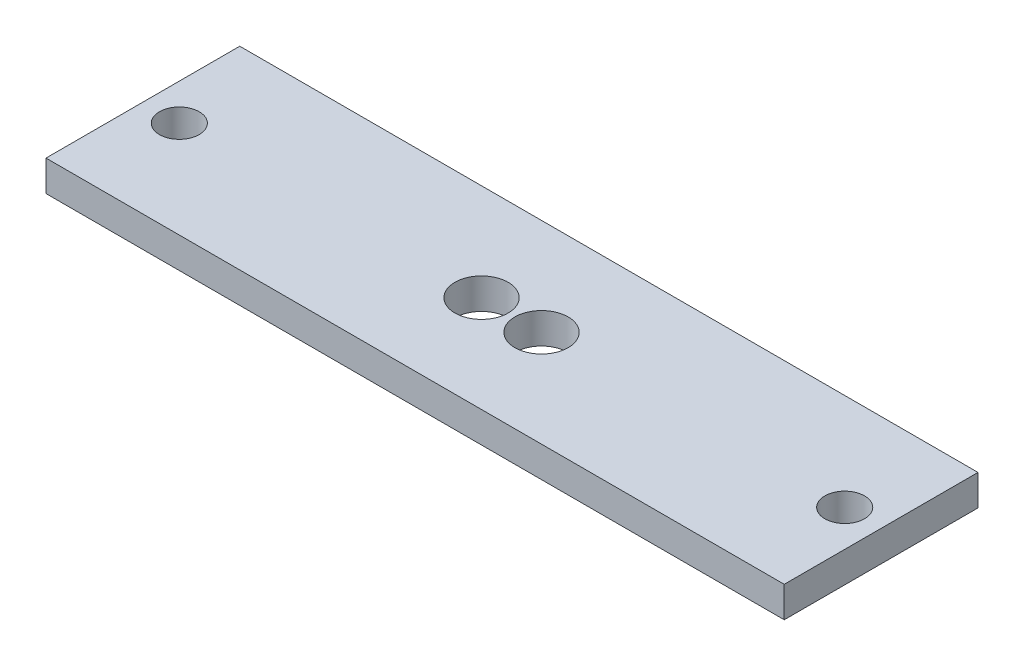
ISO-10303-21;
HEADER;
FILE_DESCRIPTION(('STEP AP214'),'2;1');
FILE_NAME('part.step','',(''),(''),'','','');
FILE_SCHEMA(('AUTOMOTIVE_DESIGN { 1 0 10303 214 1 1 1 1 }'));
ENDSEC;
DATA;
#1=APPLICATION_CONTEXT('core data for automotive mechanical design processes');
#2=APPLICATION_PROTOCOL_DEFINITION('international standard','automotive_design',2000,#1);
#3=PRODUCT_CONTEXT('',#1,'mechanical');
#4=PRODUCT('Part','Part','',(#3));
#5=PRODUCT_RELATED_PRODUCT_CATEGORY('part','',(#4));
#6=PRODUCT_DEFINITION_FORMATION('','',#4);
#7=PRODUCT_DEFINITION_CONTEXT('part definition',#1,'design');
#8=PRODUCT_DEFINITION('design','',#6,#7);
#9=PRODUCT_DEFINITION_SHAPE('','',#8);
#10=(LENGTH_UNIT() NAMED_UNIT(*) SI_UNIT(.MILLI.,.METRE.));
#11=(NAMED_UNIT(*) PLANE_ANGLE_UNIT() SI_UNIT($,.RADIAN.));
#12=(NAMED_UNIT(*) SI_UNIT($,.STERADIAN.) SOLID_ANGLE_UNIT());
#13=UNCERTAINTY_MEASURE_WITH_UNIT(LENGTH_MEASURE(1.E-05),#10,'distance_accuracy_value','');
#14=(GEOMETRIC_REPRESENTATION_CONTEXT(3) GLOBAL_UNCERTAINTY_ASSIGNED_CONTEXT((#13)) GLOBAL_UNIT_ASSIGNED_CONTEXT((#10,
#11,#12)) REPRESENTATION_CONTEXT('',''));
#15=CARTESIAN_POINT('',(0.,0.,0.));
#16=DIRECTION('',(0.,0.,1.));
#17=DIRECTION('',(1.,0.,0.));
#18=AXIS2_PLACEMENT_3D('',#15,#16,#17);
#19=CARTESIAN_POINT('',(0.,3.175,0.));
#20=DIRECTION('',(0.,1.,0.));
#21=DIRECTION('',(0.,0.,1.));
#22=AXIS2_PLACEMENT_3D('',#19,#20,#21);
#23=PLANE('',#22);
#24=CARTESIAN_POINT('',(-34.3403545192533,3.175,-0.475545854655842));
#25=DIRECTION('',(0.,1.,0.));
#26=DIRECTION('',(0.,0.,1.));
#27=AXIS2_PLACEMENT_3D('',#24,#25,#26);
#28=CIRCLE('',#27,2.04966570165474);
#29=CARTESIAN_POINT('',(-34.3403545192533,3.175,1.5741198469989));
#30=VERTEX_POINT('',#29);
#31=EDGE_CURVE('E142',#30,#30,#28,.T.);
#32=ORIENTED_EDGE('',*,*,#31,.F.);
#33=EDGE_LOOP('',(#32));
#34=FACE_BOUND('',#33,.T.);
#35=CARTESIAN_POINT('',(3.04800000000003,3.175,-0.475545854655842));
#36=DIRECTION('',(0.,1.,0.));
#37=DIRECTION('',(0.,0.,1.));
#38=AXIS2_PLACEMENT_3D('',#35,#36,#37);
#39=CIRCLE('',#38,2.75);
#40=CARTESIAN_POINT('',(3.04800000000003,3.175,2.27445414534416));
#41=VERTEX_POINT('',#40);
#42=EDGE_CURVE('E112',#41,#41,#39,.T.);
#43=ORIENTED_EDGE('',*,*,#42,.F.);
#44=EDGE_LOOP('',(#43));
#45=FACE_BOUND('',#44,.T.);
#46=DIRECTION('',(1.,0.,0.));
#47=VECTOR('',#46,1.);
#48=CARTESIAN_POINT('',(-38.1,3.175,9.52445414534415));
#49=LINE('',#48,#47);
#50=CARTESIAN_POINT('',(-38.1,3.175,9.52445414534415));
#51=VERTEX_POINT('',#50);
#52=CARTESIAN_POINT('',(38.1,3.175,9.52445414534415));
#53=VERTEX_POINT('',#52);
#54=EDGE_CURVE('E92',#51,#53,#49,.T.);
#55=ORIENTED_EDGE('',*,*,#54,.T.);
#56=DIRECTION('',(0.,0.,-1.));
#57=VECTOR('',#56,1.);
#58=CARTESIAN_POINT('',(38.1,3.175,9.52445414534415));
#59=LINE('',#58,#57);
#60=CARTESIAN_POINT('',(38.1,3.175,-10.4755458546558));
#61=VERTEX_POINT('',#60);
#62=EDGE_CURVE('E87',#53,#61,#59,.T.);
#63=ORIENTED_EDGE('',*,*,#62,.T.);
#64=DIRECTION('',(-1.,0.,0.));
#65=VECTOR('',#64,1.);
#66=CARTESIAN_POINT('',(38.1,3.175,-10.4755458546558));
#67=LINE('',#66,#65);
#68=CARTESIAN_POINT('',(-38.1,3.175,-10.4755458546558));
#69=VERTEX_POINT('',#68);
#70=EDGE_CURVE('E90',#61,#69,#67,.T.);
#71=ORIENTED_EDGE('',*,*,#70,.T.);
#72=DIRECTION('',(0.,0.,1.));
#73=VECTOR('',#72,1.);
#74=CARTESIAN_POINT('',(-38.1,3.175,-10.4755458546558));
#75=LINE('',#74,#73);
#76=EDGE_CURVE('E57',#69,#51,#75,.T.);
#77=ORIENTED_EDGE('',*,*,#76,.T.);
#78=EDGE_LOOP('',(#55,#63,#71,#77));
#79=FACE_BOUND('',#78,.T.);
#80=CARTESIAN_POINT('',(-3.14369608203411,3.175,-0.475545854655842));
#81=DIRECTION('',(0.,1.,0.));
#82=DIRECTION('',(0.,0.,1.));
#83=AXIS2_PLACEMENT_3D('',#80,#81,#82);
#84=CIRCLE('',#83,2.75);
#85=CARTESIAN_POINT('',(-3.14369608203411,3.175,2.27445414534416));
#86=VERTEX_POINT('',#85);
#87=EDGE_CURVE('E134',#86,#86,#84,.T.);
#88=ORIENTED_EDGE('',*,*,#87,.F.);
#89=EDGE_LOOP('',(#88));
#90=FACE_BOUND('',#89,.T.);
#91=CARTESIAN_POINT('',(34.3403545192534,3.175,-0.475545854655842));
#92=DIRECTION('',(0.,1.,0.));
#93=DIRECTION('',(0.,0.,1.));
#94=AXIS2_PLACEMENT_3D('',#91,#92,#93);
#95=CIRCLE('',#94,2.04966570165475);
#96=CARTESIAN_POINT('',(34.3403545192534,3.175,1.57411984699891));
#97=VERTEX_POINT('',#96);
#98=EDGE_CURVE('E150',#97,#97,#95,.T.);
#99=ORIENTED_EDGE('',*,*,#98,.F.);
#100=EDGE_LOOP('',(#99));
#101=FACE_BOUND('',#100,.T.);
#102=ADVANCED_FACE('F39',(#34,#45,#79,#90,#101),#23,.T.);
#103=CARTESIAN_POINT('',(0.,0.,0.));
#104=DIRECTION('',(0.,1.,0.));
#105=DIRECTION('',(0.,0.,1.));
#106=AXIS2_PLACEMENT_3D('',#103,#104,#105);
#107=PLANE('',#106);
#108=DIRECTION('',(1.,0.,0.));
#109=VECTOR('',#108,1.);
#110=CARTESIAN_POINT('',(-38.1,0.,9.52445414534415));
#111=LINE('',#110,#109);
#112=CARTESIAN_POINT('',(-38.1,0.,9.52445414534415));
#113=VERTEX_POINT('',#112);
#114=CARTESIAN_POINT('',(38.1,0.,9.52445414534415));
#115=VERTEX_POINT('',#114);
#116=EDGE_CURVE('E108',#113,#115,#111,.T.);
#117=ORIENTED_EDGE('',*,*,#116,.F.);
#118=DIRECTION('',(0.,0.,1.));
#119=VECTOR('',#118,1.);
#120=CARTESIAN_POINT('',(-38.1,0.,-10.4755458546558));
#121=LINE('',#120,#119);
#122=CARTESIAN_POINT('',(-38.1,0.,-10.4755458546558));
#123=VERTEX_POINT('',#122);
#124=EDGE_CURVE('E80',#123,#113,#121,.T.);
#125=ORIENTED_EDGE('',*,*,#124,.F.);
#126=DIRECTION('',(-1.,0.,0.));
#127=VECTOR('',#126,1.);
#128=CARTESIAN_POINT('',(38.1,0.,-10.4755458546558));
#129=LINE('',#128,#127);
#130=CARTESIAN_POINT('',(38.1,0.,-10.4755458546558));
#131=VERTEX_POINT('',#130);
#132=EDGE_CURVE('E74',#131,#123,#129,.T.);
#133=ORIENTED_EDGE('',*,*,#132,.F.);
#134=DIRECTION('',(0.,0.,-1.));
#135=VECTOR('',#134,1.);
#136=CARTESIAN_POINT('',(38.1,0.,9.52445414534415));
#137=LINE('',#136,#135);
#138=EDGE_CURVE('E97',#115,#131,#137,.T.);
#139=ORIENTED_EDGE('',*,*,#138,.F.);
#140=EDGE_LOOP('',(#117,#125,#133,#139));
#141=FACE_BOUND('',#140,.T.);
#142=CARTESIAN_POINT('',(3.04800000000003,0.,-0.475545854655842));
#143=DIRECTION('',(0.,1.,0.));
#144=DIRECTION('',(0.,0.,1.));
#145=AXIS2_PLACEMENT_3D('',#142,#143,#144);
#146=CIRCLE('',#145,2.75);
#147=CARTESIAN_POINT('',(3.04800000000003,0.,2.27445414534416));
#148=VERTEX_POINT('',#147);
#149=EDGE_CURVE('E130',#148,#148,#146,.T.);
#150=ORIENTED_EDGE('',*,*,#149,.T.);
#151=EDGE_LOOP('',(#150));
#152=FACE_BOUND('',#151,.T.);
#153=CARTESIAN_POINT('',(-3.14369608203411,0.,-0.475545854655842));
#154=DIRECTION('',(0.,1.,0.));
#155=DIRECTION('',(0.,0.,1.));
#156=AXIS2_PLACEMENT_3D('',#153,#154,#155);
#157=CIRCLE('',#156,2.75);
#158=CARTESIAN_POINT('',(-3.14369608203411,0.,2.27445414534416));
#159=VERTEX_POINT('',#158);
#160=EDGE_CURVE('E138',#159,#159,#157,.T.);
#161=ORIENTED_EDGE('',*,*,#160,.T.);
#162=EDGE_LOOP('',(#161));
#163=FACE_BOUND('',#162,.T.);
#164=CARTESIAN_POINT('',(-34.3403545192533,0.,-0.475545854655842));
#165=DIRECTION('',(0.,1.,0.));
#166=DIRECTION('',(0.,0.,1.));
#167=AXIS2_PLACEMENT_3D('',#164,#165,#166);
#168=CIRCLE('',#167,2.04966570165474);
#169=CARTESIAN_POINT('',(-34.3403545192533,0.,1.5741198469989));
#170=VERTEX_POINT('',#169);
#171=EDGE_CURVE('E146',#170,#170,#168,.T.);
#172=ORIENTED_EDGE('',*,*,#171,.T.);
#173=EDGE_LOOP('',(#172));
#174=FACE_BOUND('',#173,.T.);
#175=CARTESIAN_POINT('',(34.3403545192534,0.,-0.475545854655842));
#176=DIRECTION('',(0.,1.,0.));
#177=DIRECTION('',(0.,0.,1.));
#178=AXIS2_PLACEMENT_3D('',#175,#176,#177);
#179=CIRCLE('',#178,2.04966570165475);
#180=CARTESIAN_POINT('',(34.3403545192534,0.,1.57411984699891));
#181=VERTEX_POINT('',#180);
#182=EDGE_CURVE('E154',#181,#181,#179,.T.);
#183=ORIENTED_EDGE('',*,*,#182,.T.);
#184=EDGE_LOOP('',(#183));
#185=FACE_BOUND('',#184,.T.);
#186=ADVANCED_FACE('F125',(#141,#152,#163,#174,#185),#107,.F.);
#187=CARTESIAN_POINT('',(-38.1,3.175,9.52445414534415));
#188=DIRECTION('',(0.,0.,-1.));
#189=DIRECTION('',(-1.,0.,0.));
#190=AXIS2_PLACEMENT_3D('',#187,#188,#189);
#191=PLANE('',#190);
#192=ORIENTED_EDGE('',*,*,#116,.T.);
#193=DIRECTION('',(0.,-1.,0.));
#194=VECTOR('',#193,1.);
#195=CARTESIAN_POINT('',(38.1,3.175,9.52445414534415));
#196=LINE('',#195,#194);
#197=EDGE_CURVE('E11',#53,#115,#196,.T.);
#198=ORIENTED_EDGE('',*,*,#197,.F.);
#199=ORIENTED_EDGE('',*,*,#54,.F.);
#200=DIRECTION('',(0.,-1.,0.));
#201=VECTOR('',#200,1.);
#202=CARTESIAN_POINT('',(-38.1,3.175,9.52445414534415));
#203=LINE('',#202,#201);
#204=EDGE_CURVE('E104',#51,#113,#203,.T.);
#205=ORIENTED_EDGE('',*,*,#204,.T.);
#206=EDGE_LOOP('',(#192,#198,#199,#205));
#207=FACE_BOUND('',#206,.T.);
#208=ADVANCED_FACE('F41',(#207),#191,.F.);
#209=CARTESIAN_POINT('',(38.1,3.175,9.52445414534415));
#210=DIRECTION('',(-1.,0.,0.));
#211=DIRECTION('',(0.,0.,1.));
#212=AXIS2_PLACEMENT_3D('',#209,#210,#211);
#213=PLANE('',#212);
#214=ORIENTED_EDGE('',*,*,#138,.T.);
#215=DIRECTION('',(0.,-1.,0.));
#216=VECTOR('',#215,1.);
#217=CARTESIAN_POINT('',(38.1,3.175,-10.4755458546558));
#218=LINE('',#217,#216);
#219=EDGE_CURVE('E49',#61,#131,#218,.T.);
#220=ORIENTED_EDGE('',*,*,#219,.F.);
#221=ORIENTED_EDGE('',*,*,#62,.F.);
#222=ORIENTED_EDGE('',*,*,#197,.T.);
#223=EDGE_LOOP('',(#214,#220,#221,#222));
#224=FACE_BOUND('',#223,.T.);
#225=ADVANCED_FACE('F96',(#224),#213,.F.);
#226=CARTESIAN_POINT('',(38.1,3.175,-10.4755458546558));
#227=DIRECTION('',(0.,0.,1.));
#228=DIRECTION('',(1.,0.,0.));
#229=AXIS2_PLACEMENT_3D('',#226,#227,#228);
#230=PLANE('',#229);
#231=ORIENTED_EDGE('',*,*,#132,.T.);
#232=DIRECTION('',(0.,-1.,0.));
#233=VECTOR('',#232,1.);
#234=CARTESIAN_POINT('',(-38.1,3.175,-10.4755458546558));
#235=LINE('',#234,#233);
#236=EDGE_CURVE('E99',#69,#123,#235,.T.);
#237=ORIENTED_EDGE('',*,*,#236,.F.);
#238=ORIENTED_EDGE('',*,*,#70,.F.);
#239=ORIENTED_EDGE('',*,*,#219,.T.);
#240=EDGE_LOOP('',(#231,#237,#238,#239));
#241=FACE_BOUND('',#240,.T.);
#242=ADVANCED_FACE('F100',(#241),#230,.F.);
#243=CARTESIAN_POINT('',(-38.1,3.175,-10.4755458546558));
#244=DIRECTION('',(1.,0.,0.));
#245=DIRECTION('',(0.,0.,-1.));
#246=AXIS2_PLACEMENT_3D('',#243,#244,#245);
#247=PLANE('',#246);
#248=ORIENTED_EDGE('',*,*,#124,.T.);
#249=ORIENTED_EDGE('',*,*,#204,.F.);
#250=ORIENTED_EDGE('',*,*,#76,.F.);
#251=ORIENTED_EDGE('',*,*,#236,.T.);
#252=EDGE_LOOP('',(#248,#249,#250,#251));
#253=FACE_BOUND('',#252,.T.);
#254=ADVANCED_FACE('F122',(#253),#247,.F.);
#255=CARTESIAN_POINT('',(3.04800000000003,3.175,-0.475545854655842));
#256=DIRECTION('',(0.,-1.,0.));
#257=DIRECTION('',(0.,0.,-1.));
#258=AXIS2_PLACEMENT_3D('',#255,#256,#257);
#259=CYLINDRICAL_SURFACE('',#258,2.75);
#260=ORIENTED_EDGE('',*,*,#42,.T.);
#261=EDGE_LOOP('',(#260));
#262=FACE_BOUND('',#261,.T.);
#263=ORIENTED_EDGE('',*,*,#149,.F.);
#264=EDGE_LOOP('',(#263));
#265=FACE_BOUND('',#264,.T.);
#266=ADVANCED_FACE('F175',(#262,#265),#259,.F.);
#267=CARTESIAN_POINT('',(-3.14369608203411,3.175,-0.475545854655842));
#268=DIRECTION('',(0.,-1.,0.));
#269=DIRECTION('',(0.,0.,-1.));
#270=AXIS2_PLACEMENT_3D('',#267,#268,#269);
#271=CYLINDRICAL_SURFACE('',#270,2.75);
#272=ORIENTED_EDGE('',*,*,#87,.T.);
#273=EDGE_LOOP('',(#272));
#274=FACE_BOUND('',#273,.T.);
#275=ORIENTED_EDGE('',*,*,#160,.F.);
#276=EDGE_LOOP('',(#275));
#277=FACE_BOUND('',#276,.T.);
#278=ADVANCED_FACE('F221',(#274,#277),#271,.F.);
#279=CARTESIAN_POINT('',(-34.3403545192533,3.175,-0.475545854655842));
#280=DIRECTION('',(0.,-1.,0.));
#281=DIRECTION('',(0.,0.,-1.));
#282=AXIS2_PLACEMENT_3D('',#279,#280,#281);
#283=CYLINDRICAL_SURFACE('',#282,2.04966570165474);
#284=ORIENTED_EDGE('',*,*,#31,.T.);
#285=EDGE_LOOP('',(#284));
#286=FACE_BOUND('',#285,.T.);
#287=ORIENTED_EDGE('',*,*,#171,.F.);
#288=EDGE_LOOP('',(#287));
#289=FACE_BOUND('',#288,.T.);
#290=ADVANCED_FACE('F229',(#286,#289),#283,.F.);
#291=CARTESIAN_POINT('',(34.3403545192534,3.175,-0.475545854655842));
#292=DIRECTION('',(0.,-1.,0.));
#293=DIRECTION('',(0.,0.,-1.));
#294=AXIS2_PLACEMENT_3D('',#291,#292,#293);
#295=CYLINDRICAL_SURFACE('',#294,2.04966570165475);
#296=ORIENTED_EDGE('',*,*,#98,.T.);
#297=EDGE_LOOP('',(#296));
#298=FACE_BOUND('',#297,.T.);
#299=ORIENTED_EDGE('',*,*,#182,.F.);
#300=EDGE_LOOP('',(#299));
#301=FACE_BOUND('',#300,.T.);
#302=ADVANCED_FACE('F162',(#298,#301),#295,.F.);
#303=CLOSED_SHELL('',(#102,#186,#208,#225,#242,#254,#266,#278,#290,#302));
#304=MANIFOLD_SOLID_BREP('B2',#303);
#305=ADVANCED_BREP_SHAPE_REPRESENTATION('',(#18,#304),#14);
#306=SHAPE_DEFINITION_REPRESENTATION(#9,#305);
ENDSEC;
END-ISO-10303-21;
